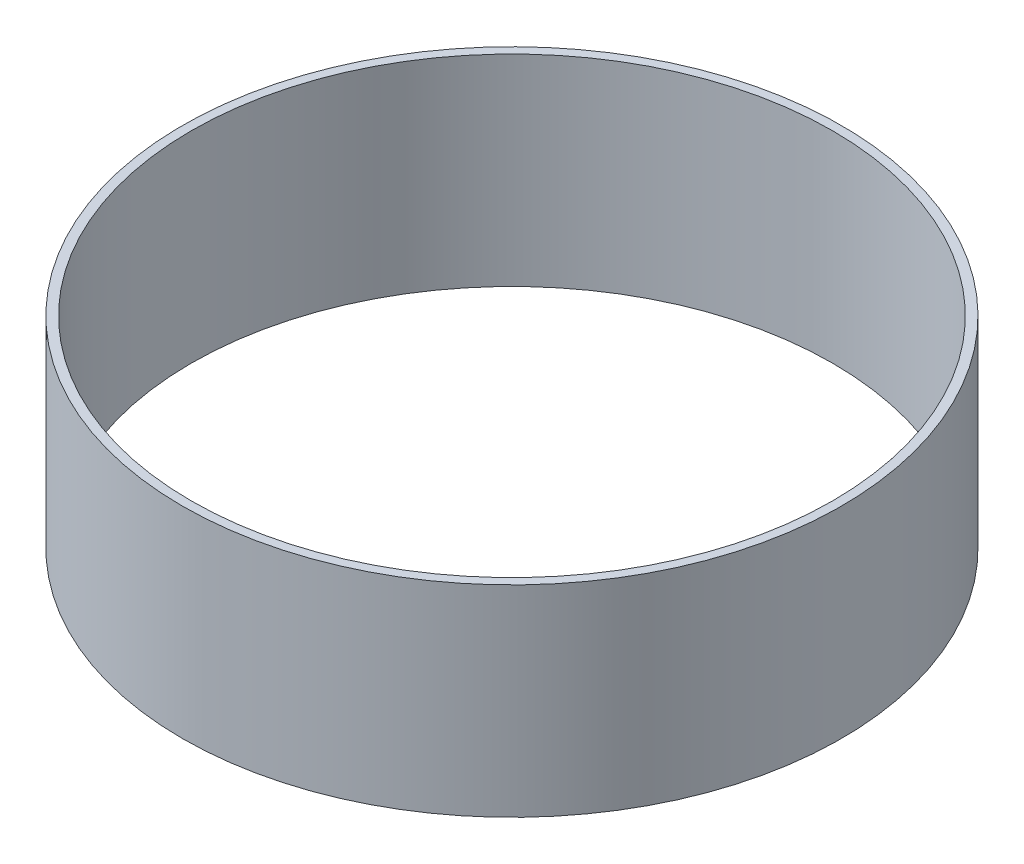
ISO-10303-21;
HEADER;
FILE_DESCRIPTION(('STEP AP214'),'2;1');
FILE_NAME('part.step','',(''),(''),'','','');
FILE_SCHEMA(('AUTOMOTIVE_DESIGN { 1 0 10303 214 1 1 1 1 }'));
ENDSEC;
DATA;
#1=APPLICATION_CONTEXT('core data for automotive mechanical design processes');
#2=APPLICATION_PROTOCOL_DEFINITION('international standard','automotive_design',2000,#1);
#3=PRODUCT_CONTEXT('',#1,'mechanical');
#4=PRODUCT('Part','Part','',(#3));
#5=PRODUCT_RELATED_PRODUCT_CATEGORY('part','',(#4));
#6=PRODUCT_DEFINITION_FORMATION('','',#4);
#7=PRODUCT_DEFINITION_CONTEXT('part definition',#1,'design');
#8=PRODUCT_DEFINITION('design','',#6,#7);
#9=PRODUCT_DEFINITION_SHAPE('','',#8);
#10=(LENGTH_UNIT() NAMED_UNIT(*) SI_UNIT(.MILLI.,.METRE.));
#11=(NAMED_UNIT(*) PLANE_ANGLE_UNIT() SI_UNIT($,.RADIAN.));
#12=(NAMED_UNIT(*) SI_UNIT($,.STERADIAN.) SOLID_ANGLE_UNIT());
#13=UNCERTAINTY_MEASURE_WITH_UNIT(LENGTH_MEASURE(1.E-05),#10,'distance_accuracy_value','');
#14=(GEOMETRIC_REPRESENTATION_CONTEXT(3) GLOBAL_UNCERTAINTY_ASSIGNED_CONTEXT((#13)) GLOBAL_UNIT_ASSIGNED_CONTEXT((#10,
#11,#12)) REPRESENTATION_CONTEXT('',''));
#15=CARTESIAN_POINT('',(0.,0.,0.));
#16=DIRECTION('',(0.,0.,1.));
#17=DIRECTION('',(1.,0.,0.));
#18=AXIS2_PLACEMENT_3D('',#15,#16,#17);
#19=CARTESIAN_POINT('',(0.,27.,0.));
#20=DIRECTION('',(0.,1.,0.));
#21=DIRECTION('',(0.,0.,1.));
#22=AXIS2_PLACEMENT_3D('',#19,#20,#21);
#23=PLANE('',#22);
#24=CARTESIAN_POINT('',(0.,27.,0.));
#25=DIRECTION('',(0.,1.,0.));
#26=DIRECTION('',(0.,0.,1.));
#27=AXIS2_PLACEMENT_3D('',#24,#25,#26);
#28=CIRCLE('',#27,44.2);
#29=CARTESIAN_POINT('',(0.,27.,44.2));
#30=VERTEX_POINT('',#29);
#31=EDGE_CURVE('E10',#30,#30,#28,.T.);
#32=ORIENTED_EDGE('',*,*,#31,.T.);
#33=EDGE_LOOP('',(#32));
#34=FACE_BOUND('',#33,.T.);
#35=CARTESIAN_POINT('',(0.,27.,0.));
#36=DIRECTION('',(0.,1.,0.));
#37=DIRECTION('',(0.,0.,1.));
#38=AXIS2_PLACEMENT_3D('',#35,#36,#37);
#39=CIRCLE('',#38,43.);
#40=CARTESIAN_POINT('',(0.,27.,43.));
#41=VERTEX_POINT('',#40);
#42=EDGE_CURVE('E56',#41,#41,#39,.T.);
#43=ORIENTED_EDGE('',*,*,#42,.F.);
#44=EDGE_LOOP('',(#43));
#45=FACE_BOUND('',#44,.T.);
#46=ADVANCED_FACE('F43',(#34,#45),#23,.T.);
#47=CARTESIAN_POINT('',(0.,0.,0.));
#48=DIRECTION('',(0.,1.,0.));
#49=DIRECTION('',(0.,0.,1.));
#50=AXIS2_PLACEMENT_3D('',#47,#48,#49);
#51=PLANE('',#50);
#52=CARTESIAN_POINT('',(0.,0.,0.));
#53=DIRECTION('',(0.,1.,0.));
#54=DIRECTION('',(0.,0.,1.));
#55=AXIS2_PLACEMENT_3D('',#52,#53,#54);
#56=CIRCLE('',#55,44.2);
#57=CARTESIAN_POINT('',(0.,0.,44.2));
#58=VERTEX_POINT('',#57);
#59=EDGE_CURVE('E47',#58,#58,#56,.T.);
#60=ORIENTED_EDGE('',*,*,#59,.F.);
#61=EDGE_LOOP('',(#60));
#62=FACE_BOUND('',#61,.T.);
#63=CARTESIAN_POINT('',(0.,0.,0.));
#64=DIRECTION('',(0.,1.,0.));
#65=DIRECTION('',(0.,0.,1.));
#66=AXIS2_PLACEMENT_3D('',#63,#64,#65);
#67=CIRCLE('',#66,43.);
#68=CARTESIAN_POINT('',(0.,0.,43.));
#69=VERTEX_POINT('',#68);
#70=EDGE_CURVE('E58',#69,#69,#67,.T.);
#71=ORIENTED_EDGE('',*,*,#70,.T.);
#72=EDGE_LOOP('',(#71));
#73=FACE_BOUND('',#72,.T.);
#74=ADVANCED_FACE('F70',(#62,#73),#51,.F.);
#75=CARTESIAN_POINT('',(0.,27.,0.));
#76=DIRECTION('',(0.,-1.,0.));
#77=DIRECTION('',(0.,0.,-1.));
#78=AXIS2_PLACEMENT_3D('',#75,#76,#77);
#79=CYLINDRICAL_SURFACE('',#78,44.2);
#80=ORIENTED_EDGE('',*,*,#31,.F.);
#81=EDGE_LOOP('',(#80));
#82=FACE_BOUND('',#81,.T.);
#83=ORIENTED_EDGE('',*,*,#59,.T.);
#84=EDGE_LOOP('',(#83));
#85=FACE_BOUND('',#84,.T.);
#86=ADVANCED_FACE('F45',(#82,#85),#79,.T.);
#87=CARTESIAN_POINT('',(0.,27.,0.));
#88=DIRECTION('',(0.,-1.,0.));
#89=DIRECTION('',(0.,0.,-1.));
#90=AXIS2_PLACEMENT_3D('',#87,#88,#89);
#91=CYLINDRICAL_SURFACE('',#90,43.);
#92=ORIENTED_EDGE('',*,*,#42,.T.);
#93=EDGE_LOOP('',(#92));
#94=FACE_BOUND('',#93,.T.);
#95=ORIENTED_EDGE('',*,*,#70,.F.);
#96=EDGE_LOOP('',(#95));
#97=FACE_BOUND('',#96,.T.);
#98=ADVANCED_FACE('F66',(#94,#97),#91,.F.);
#99=CLOSED_SHELL('',(#46,#74,#86,#98));
#100=MANIFOLD_SOLID_BREP('B2',#99);
#101=ADVANCED_BREP_SHAPE_REPRESENTATION('',(#18,#100),#14);
#102=SHAPE_DEFINITION_REPRESENTATION(#9,#101);
ENDSEC;
END-ISO-10303-21;
